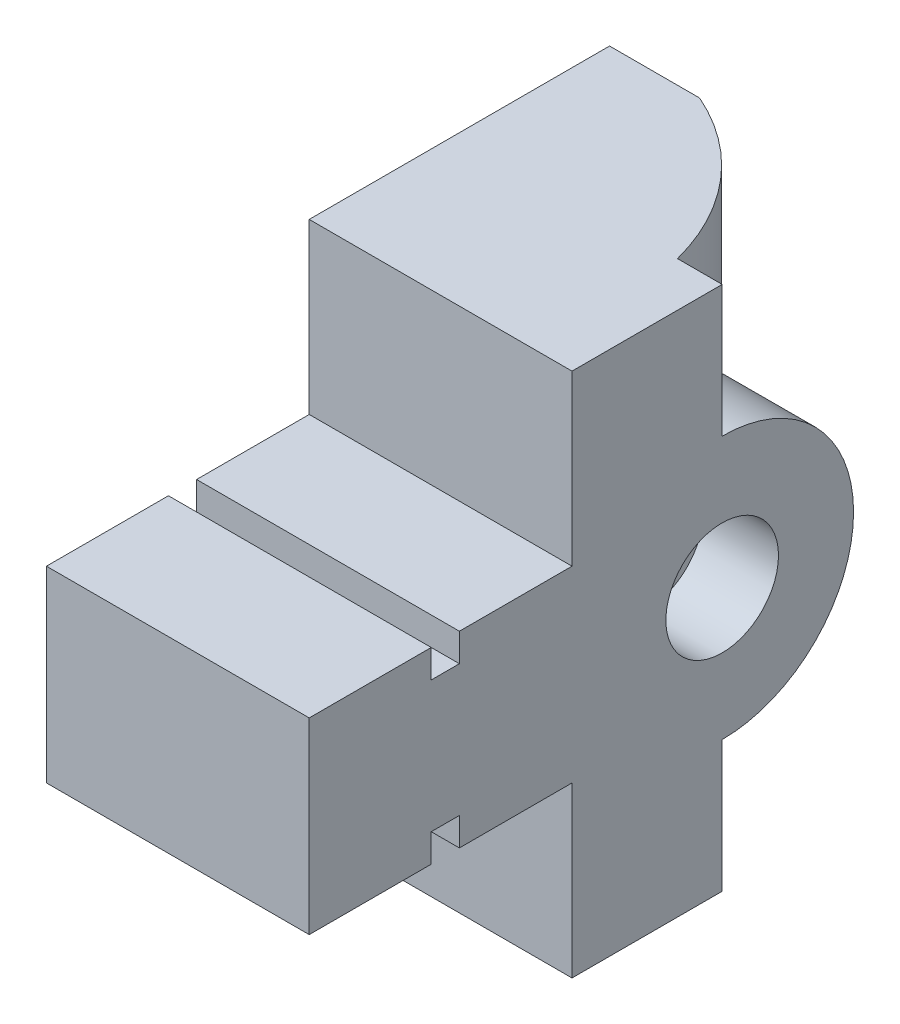
ISO-10303-21;
HEADER;
FILE_DESCRIPTION(('STEP AP214'),'2;1');
FILE_NAME('part.step','',(''),(''),'','','');
FILE_SCHEMA(('AUTOMOTIVE_DESIGN { 1 0 10303 214 1 1 1 1 }'));
ENDSEC;
DATA;
#1=APPLICATION_CONTEXT('core data for automotive mechanical design processes');
#2=APPLICATION_PROTOCOL_DEFINITION('international standard','automotive_design',2000,#1);
#3=PRODUCT_CONTEXT('',#1,'mechanical');
#4=PRODUCT('Part','Part','',(#3));
#5=PRODUCT_RELATED_PRODUCT_CATEGORY('part','',(#4));
#6=PRODUCT_DEFINITION_FORMATION('','',#4);
#7=PRODUCT_DEFINITION_CONTEXT('part definition',#1,'design');
#8=PRODUCT_DEFINITION('design','',#6,#7);
#9=PRODUCT_DEFINITION_SHAPE('','',#8);
#10=(LENGTH_UNIT() NAMED_UNIT(*) SI_UNIT(.MILLI.,.METRE.));
#11=(NAMED_UNIT(*) PLANE_ANGLE_UNIT() SI_UNIT($,.RADIAN.));
#12=(NAMED_UNIT(*) SI_UNIT($,.STERADIAN.) SOLID_ANGLE_UNIT());
#13=UNCERTAINTY_MEASURE_WITH_UNIT(LENGTH_MEASURE(1.E-05),#10,'distance_accuracy_value','');
#14=(GEOMETRIC_REPRESENTATION_CONTEXT(3) GLOBAL_UNCERTAINTY_ASSIGNED_CONTEXT((#13)) GLOBAL_UNIT_ASSIGNED_CONTEXT((#10,
#11,#12)) REPRESENTATION_CONTEXT('',''));
#15=CARTESIAN_POINT('',(0.,0.,0.));
#16=DIRECTION('',(0.,0.,1.));
#17=DIRECTION('',(1.,0.,0.));
#18=AXIS2_PLACEMENT_3D('',#15,#16,#17);
#19=CARTESIAN_POINT('',(0.,88.9,44.45));
#20=DIRECTION('',(0.,0.,-1.));
#21=DIRECTION('',(-1.,0.,0.));
#22=AXIS2_PLACEMENT_3D('',#19,#20,#21);
#23=PLANE('',#22);
#24=DIRECTION('',(1.,0.,0.));
#25=VECTOR('',#24,1.);
#26=CARTESIAN_POINT('',(0.,60.325,44.45));
#27=LINE('',#26,#25);
#28=CARTESIAN_POINT('',(0.,60.325,44.45));
#29=VERTEX_POINT('',#28);
#30=CARTESIAN_POINT('',(44.45,60.325,44.45));
#31=VERTEX_POINT('',#30);
#32=EDGE_CURVE('E218',#29,#31,#27,.T.);
#33=ORIENTED_EDGE('',*,*,#32,.F.);
#34=DIRECTION('',(0.,-1.,0.));
#35=VECTOR('',#34,1.);
#36=CARTESIAN_POINT('',(0.,88.9,44.45));
#37=LINE('',#36,#35);
#38=CARTESIAN_POINT('',(0.,28.575,44.45));
#39=VERTEX_POINT('',#38);
#40=EDGE_CURVE('E11',#29,#39,#37,.T.);
#41=ORIENTED_EDGE('',*,*,#40,.T.);
#42=DIRECTION('',(1.,0.,0.));
#43=VECTOR('',#42,1.);
#44=CARTESIAN_POINT('',(0.,28.575,44.45));
#45=LINE('',#44,#43);
#46=CARTESIAN_POINT('',(44.45,28.575,44.45));
#47=VERTEX_POINT('',#46);
#48=EDGE_CURVE('E272',#39,#47,#45,.T.);
#49=ORIENTED_EDGE('',*,*,#48,.T.);
#50=DIRECTION('',(0.,-1.,0.));
#51=VECTOR('',#50,1.);
#52=CARTESIAN_POINT('',(44.45,88.9,44.45));
#53=LINE('',#52,#51);
#54=EDGE_CURVE('E43',#31,#47,#53,.T.);
#55=ORIENTED_EDGE('',*,*,#54,.F.);
#56=EDGE_LOOP('',(#33,#41,#49,#55));
#57=FACE_BOUND('',#56,.T.);
#58=ADVANCED_FACE('F36',(#57),#23,.F.);
#59=CARTESIAN_POINT('',(44.45,88.9,44.45));
#60=DIRECTION('',(-1.,0.,0.));
#61=DIRECTION('',(0.,0.,1.));
#62=AXIS2_PLACEMENT_3D('',#59,#60,#61);
#63=PLANE('',#62);
#64=CARTESIAN_POINT('',(44.45,44.45,-25.4));
#65=DIRECTION('',(1.,0.,0.));
#66=DIRECTION('',(0.,0.,-1.));
#67=AXIS2_PLACEMENT_3D('',#64,#65,#66);
#68=CIRCLE('',#67,9.525);
#69=CARTESIAN_POINT('',(44.45,44.45,-34.925));
#70=VERTEX_POINT('',#69);
#71=EDGE_CURVE('E220',#70,#70,#68,.T.);
#72=ORIENTED_EDGE('',*,*,#71,.F.);
#73=EDGE_LOOP('',(#72));
#74=FACE_BOUND('',#73,.T.);
#75=DIRECTION('',(0.,0.,1.));
#76=VECTOR('',#75,1.);
#77=CARTESIAN_POINT('',(44.45,60.325,0.));
#78=LINE('',#77,#76);
#79=CARTESIAN_POINT('',(44.45,60.325,23.8125));
#80=VERTEX_POINT('',#79);
#81=EDGE_CURVE('E189',#80,#31,#78,.T.);
#82=ORIENTED_EDGE('',*,*,#81,.T.);
#83=ORIENTED_EDGE('',*,*,#54,.T.);
#84=DIRECTION('',(0.,0.,1.));
#85=VECTOR('',#84,1.);
#86=CARTESIAN_POINT('',(44.45,28.575,0.));
#87=LINE('',#86,#85);
#88=CARTESIAN_POINT('',(44.45,28.575,23.8125));
#89=VERTEX_POINT('',#88);
#90=EDGE_CURVE('E250',#89,#47,#87,.T.);
#91=ORIENTED_EDGE('',*,*,#90,.F.);
#92=DIRECTION('',(0.,-1.,0.));
#93=VECTOR('',#92,1.);
#94=CARTESIAN_POINT('',(44.45,0.,23.8125));
#95=LINE('',#94,#93);
#96=CARTESIAN_POINT('',(44.45,33.3375,23.8125));
#97=VERTEX_POINT('',#96);
#98=EDGE_CURVE('E247',#97,#89,#95,.T.);
#99=ORIENTED_EDGE('',*,*,#98,.F.);
#100=DIRECTION('',(0.,0.,1.));
#101=VECTOR('',#100,1.);
#102=CARTESIAN_POINT('',(44.45,33.3375,0.));
#103=LINE('',#102,#101);
#104=CARTESIAN_POINT('',(44.45,33.3375,19.05));
#105=VERTEX_POINT('',#104);
#106=EDGE_CURVE('E234',#105,#97,#103,.T.);
#107=ORIENTED_EDGE('',*,*,#106,.F.);
#108=DIRECTION('',(0.,1.,0.));
#109=VECTOR('',#108,1.);
#110=CARTESIAN_POINT('',(44.45,0.,19.05));
#111=LINE('',#110,#109);
#112=CARTESIAN_POINT('',(44.45,28.575,19.05));
#113=VERTEX_POINT('',#112);
#114=EDGE_CURVE('E258',#113,#105,#111,.T.);
#115=ORIENTED_EDGE('',*,*,#114,.F.);
#116=DIRECTION('',(0.,0.,1.));
#117=VECTOR('',#116,1.);
#118=CARTESIAN_POINT('',(44.45,28.575,0.));
#119=LINE('',#118,#117);
#120=CARTESIAN_POINT('',(44.45,28.575,0.));
#121=VERTEX_POINT('',#120);
#122=EDGE_CURVE('E255',#121,#113,#119,.T.);
#123=ORIENTED_EDGE('',*,*,#122,.F.);
#124=DIRECTION('',(0.,1.,0.));
#125=VECTOR('',#124,1.);
#126=CARTESIAN_POINT('',(44.45,0.,0.));
#127=LINE('',#126,#125);
#128=CARTESIAN_POINT('',(44.45,0.,0.));
#129=VERTEX_POINT('',#128);
#130=EDGE_CURVE('E252',#129,#121,#127,.T.);
#131=ORIENTED_EDGE('',*,*,#130,.F.);
#132=DIRECTION('',(0.,0.,-1.));
#133=VECTOR('',#132,1.);
#134=CARTESIAN_POINT('',(44.45,0.,44.45));
#135=LINE('',#134,#133);
#136=CARTESIAN_POINT('',(44.45,0.,-25.4));
#137=VERTEX_POINT('',#136);
#138=EDGE_CURVE('E298',#129,#137,#135,.T.);
#139=ORIENTED_EDGE('',*,*,#138,.T.);
#140=DIRECTION('',(0.,-1.,0.));
#141=VECTOR('',#140,1.);
#142=CARTESIAN_POINT('',(44.45,88.9,-25.4));
#143=LINE('',#142,#141);
#144=CARTESIAN_POINT('',(44.45,22.225,-25.4));
#145=VERTEX_POINT('',#144);
#146=EDGE_CURVE('E385',#145,#137,#143,.T.);
#147=ORIENTED_EDGE('',*,*,#146,.F.);
#148=CARTESIAN_POINT('',(44.45,44.45,-25.4));
#149=DIRECTION('',(1.,0.,0.));
#150=DIRECTION('',(0.,0.,-1.));
#151=AXIS2_PLACEMENT_3D('',#148,#149,#150);
#152=CIRCLE('',#151,22.225);
#153=CARTESIAN_POINT('',(44.45,66.675,-25.4));
#154=VERTEX_POINT('',#153);
#155=EDGE_CURVE('E279',#145,#154,#152,.T.);
#156=ORIENTED_EDGE('',*,*,#155,.T.);
#157=CARTESIAN_POINT('',(44.45,88.9,-25.4));
#158=VERTEX_POINT('',#157);
#159=EDGE_CURVE('E386',#158,#154,#143,.T.);
#160=ORIENTED_EDGE('',*,*,#159,.F.);
#161=DIRECTION('',(0.,0.,-1.));
#162=VECTOR('',#161,1.);
#163=CARTESIAN_POINT('',(44.45,88.9,44.45));
#164=LINE('',#163,#162);
#165=CARTESIAN_POINT('',(44.45,88.9,0.));
#166=VERTEX_POINT('',#165);
#167=EDGE_CURVE('E365',#166,#158,#164,.T.);
#168=ORIENTED_EDGE('',*,*,#167,.F.);
#169=DIRECTION('',(0.,-1.,0.));
#170=VECTOR('',#169,1.);
#171=CARTESIAN_POINT('',(44.45,0.,0.));
#172=LINE('',#171,#170);
#173=CARTESIAN_POINT('',(44.45,60.325,0.));
#174=VERTEX_POINT('',#173);
#175=EDGE_CURVE('E50',#166,#174,#172,.T.);
#176=ORIENTED_EDGE('',*,*,#175,.T.);
#177=DIRECTION('',(0.,0.,1.));
#178=VECTOR('',#177,1.);
#179=CARTESIAN_POINT('',(44.45,60.325,0.));
#180=LINE('',#179,#178);
#181=CARTESIAN_POINT('',(44.45,60.325,19.05));
#182=VERTEX_POINT('',#181);
#183=EDGE_CURVE('E197',#174,#182,#180,.T.);
#184=ORIENTED_EDGE('',*,*,#183,.T.);
#185=DIRECTION('',(0.,-1.,0.));
#186=VECTOR('',#185,1.);
#187=CARTESIAN_POINT('',(44.45,0.,19.05));
#188=LINE('',#187,#186);
#189=CARTESIAN_POINT('',(44.45,55.5625,19.05));
#190=VERTEX_POINT('',#189);
#191=EDGE_CURVE('E213',#182,#190,#188,.T.);
#192=ORIENTED_EDGE('',*,*,#191,.T.);
#193=DIRECTION('',(0.,0.,1.));
#194=VECTOR('',#193,1.);
#195=CARTESIAN_POINT('',(44.45,55.5625,0.));
#196=LINE('',#195,#194);
#197=CARTESIAN_POINT('',(44.45,55.5625,23.8125));
#198=VERTEX_POINT('',#197);
#199=EDGE_CURVE('E210',#190,#198,#196,.T.);
#200=ORIENTED_EDGE('',*,*,#199,.T.);
#201=DIRECTION('',(0.,1.,0.));
#202=VECTOR('',#201,1.);
#203=CARTESIAN_POINT('',(44.45,0.,23.8125));
#204=LINE('',#203,#202);
#205=EDGE_CURVE('E207',#198,#80,#204,.T.);
#206=ORIENTED_EDGE('',*,*,#205,.T.);
#207=EDGE_LOOP('',(#82,#83,#91,#99,#107,#115,#123,#131,#139,#147,#156,#160,#168,#176,#184,#192,
#200,#206));
#208=FACE_BOUND('',#207,.T.);
#209=ADVANCED_FACE('F324',(#74,#208),#63,.F.);
#210=CARTESIAN_POINT('',(0.,88.9,0.));
#211=DIRECTION('',(1.,0.,0.));
#212=DIRECTION('',(0.,0.,-1.));
#213=AXIS2_PLACEMENT_3D('',#210,#211,#212);
#214=PLANE('',#213);
#215=DIRECTION('',(0.,0.,1.));
#216=VECTOR('',#215,1.);
#217=CARTESIAN_POINT('',(0.,60.325,0.));
#218=LINE('',#217,#216);
#219=CARTESIAN_POINT('',(0.,60.325,23.8125));
#220=VERTEX_POINT('',#219);
#221=EDGE_CURVE('E183',#220,#29,#218,.T.);
#222=ORIENTED_EDGE('',*,*,#221,.F.);
#223=DIRECTION('',(0.,1.,0.));
#224=VECTOR('',#223,1.);
#225=CARTESIAN_POINT('',(0.,0.,23.8125));
#226=LINE('',#225,#224);
#227=CARTESIAN_POINT('',(0.,55.5625,23.8125));
#228=VERTEX_POINT('',#227);
#229=EDGE_CURVE('E172',#228,#220,#226,.T.);
#230=ORIENTED_EDGE('',*,*,#229,.F.);
#231=DIRECTION('',(0.,0.,1.));
#232=VECTOR('',#231,1.);
#233=CARTESIAN_POINT('',(0.,55.5625,0.));
#234=LINE('',#233,#232);
#235=CARTESIAN_POINT('',(0.,55.5625,19.05));
#236=VERTEX_POINT('',#235);
#237=EDGE_CURVE('E182',#236,#228,#234,.T.);
#238=ORIENTED_EDGE('',*,*,#237,.F.);
#239=DIRECTION('',(0.,-1.,0.));
#240=VECTOR('',#239,1.);
#241=CARTESIAN_POINT('',(0.,0.,19.05));
#242=LINE('',#241,#240);
#243=CARTESIAN_POINT('',(0.,60.325,19.05));
#244=VERTEX_POINT('',#243);
#245=EDGE_CURVE('E201',#244,#236,#242,.T.);
#246=ORIENTED_EDGE('',*,*,#245,.F.);
#247=DIRECTION('',(0.,0.,1.));
#248=VECTOR('',#247,1.);
#249=CARTESIAN_POINT('',(0.,60.325,0.));
#250=LINE('',#249,#248);
#251=CARTESIAN_POINT('',(0.,60.325,0.));
#252=VERTEX_POINT('',#251);
#253=EDGE_CURVE('E203',#252,#244,#250,.T.);
#254=ORIENTED_EDGE('',*,*,#253,.F.);
#255=DIRECTION('',(0.,-1.,0.));
#256=VECTOR('',#255,1.);
#257=CARTESIAN_POINT('',(0.,0.,0.));
#258=LINE('',#257,#256);
#259=CARTESIAN_POINT('',(0.,88.9,0.));
#260=VERTEX_POINT('',#259);
#261=EDGE_CURVE('E191',#260,#252,#258,.T.);
#262=ORIENTED_EDGE('',*,*,#261,.F.);
#263=DIRECTION('',(0.,0.,1.));
#264=VECTOR('',#263,1.);
#265=CARTESIAN_POINT('',(0.,88.9,0.));
#266=LINE('',#265,#264);
#267=CARTESIAN_POINT('',(0.,88.9,-50.8));
#268=VERTEX_POINT('',#267);
#269=EDGE_CURVE('E299',#268,#260,#266,.T.);
#270=ORIENTED_EDGE('',*,*,#269,.F.);
#271=DIRECTION('',(0.,-1.,0.));
#272=VECTOR('',#271,1.);
#273=CARTESIAN_POINT('',(0.,88.9,-50.8));
#274=LINE('',#273,#272);
#275=CARTESIAN_POINT('',(0.,0.,-50.8));
#276=VERTEX_POINT('',#275);
#277=EDGE_CURVE('E376',#268,#276,#274,.T.);
#278=ORIENTED_EDGE('',*,*,#277,.T.);
#279=DIRECTION('',(0.,0.,1.));
#280=VECTOR('',#279,1.);
#281=CARTESIAN_POINT('',(0.,0.,0.));
#282=LINE('',#281,#280);
#283=CARTESIAN_POINT('',(0.,0.,0.));
#284=VERTEX_POINT('',#283);
#285=EDGE_CURVE('E366',#276,#284,#282,.T.);
#286=ORIENTED_EDGE('',*,*,#285,.T.);
#287=DIRECTION('',(0.,1.,0.));
#288=VECTOR('',#287,1.);
#289=CARTESIAN_POINT('',(0.,0.,0.));
#290=LINE('',#289,#288);
#291=CARTESIAN_POINT('',(0.,28.575,0.));
#292=VERTEX_POINT('',#291);
#293=EDGE_CURVE('E58',#284,#292,#290,.T.);
#294=ORIENTED_EDGE('',*,*,#293,.T.);
#295=DIRECTION('',(0.,0.,1.));
#296=VECTOR('',#295,1.);
#297=CARTESIAN_POINT('',(0.,28.575,0.));
#298=LINE('',#297,#296);
#299=CARTESIAN_POINT('',(0.,28.575,19.05));
#300=VERTEX_POINT('',#299);
#301=EDGE_CURVE('E237',#292,#300,#298,.T.);
#302=ORIENTED_EDGE('',*,*,#301,.T.);
#303=DIRECTION('',(0.,1.,0.));
#304=VECTOR('',#303,1.);
#305=CARTESIAN_POINT('',(0.,0.,19.05));
#306=LINE('',#305,#304);
#307=CARTESIAN_POINT('',(0.,33.3375,19.05));
#308=VERTEX_POINT('',#307);
#309=EDGE_CURVE('E240',#300,#308,#306,.T.);
#310=ORIENTED_EDGE('',*,*,#309,.T.);
#311=DIRECTION('',(0.,0.,1.));
#312=VECTOR('',#311,1.);
#313=CARTESIAN_POINT('',(0.,33.3375,0.));
#314=LINE('',#313,#312);
#315=CARTESIAN_POINT('',(0.,33.3375,23.8125));
#316=VERTEX_POINT('',#315);
#317=EDGE_CURVE('E243',#308,#316,#314,.T.);
#318=ORIENTED_EDGE('',*,*,#317,.T.);
#319=DIRECTION('',(0.,-1.,0.));
#320=VECTOR('',#319,1.);
#321=CARTESIAN_POINT('',(0.,0.,23.8125));
#322=LINE('',#321,#320);
#323=CARTESIAN_POINT('',(0.,28.575,23.8125));
#324=VERTEX_POINT('',#323);
#325=EDGE_CURVE('E230',#316,#324,#322,.T.);
#326=ORIENTED_EDGE('',*,*,#325,.T.);
#327=DIRECTION('',(0.,0.,1.));
#328=VECTOR('',#327,1.);
#329=CARTESIAN_POINT('',(0.,28.575,0.));
#330=LINE('',#329,#328);
#331=EDGE_CURVE('E233',#324,#39,#330,.T.);
#332=ORIENTED_EDGE('',*,*,#331,.T.);
#333=ORIENTED_EDGE('',*,*,#40,.F.);
#334=EDGE_LOOP('',(#222,#230,#238,#246,#254,#262,#270,#278,#286,#294,#302,#310,#318,#326,#332,#333));
#335=FACE_BOUND('',#334,.T.);
#336=ADVANCED_FACE('F194',(#335),#214,.F.);
#337=CARTESIAN_POINT('',(0.,88.9,-15.875));
#338=DIRECTION('',(0.,1.,0.));
#339=DIRECTION('',(0.,0.,1.));
#340=AXIS2_PLACEMENT_3D('',#337,#338,#339);
#341=PLANE('',#340);
#342=ORIENTED_EDGE('',*,*,#269,.T.);
#343=DIRECTION('',(1.,0.,0.));
#344=VECTOR('',#343,1.);
#345=CARTESIAN_POINT('',(0.,88.9,0.));
#346=LINE('',#345,#344);
#347=EDGE_CURVE('E221',#260,#166,#346,.T.);
#348=ORIENTED_EDGE('',*,*,#347,.T.);
#349=ORIENTED_EDGE('',*,*,#167,.T.);
#350=DIRECTION('',(-1.,0.,0.));
#351=VECTOR('',#350,1.);
#352=CARTESIAN_POINT('',(44.45,88.9,-25.4));
#353=LINE('',#352,#351);
#354=CARTESIAN_POINT('',(36.8901663726257,88.9,-25.4));
#355=VERTEX_POINT('',#354);
#356=EDGE_CURVE('E367',#158,#355,#353,.T.);
#357=ORIENTED_EDGE('',*,*,#356,.T.);
#358=CARTESIAN_POINT('',(0.,88.9,-15.875));
#359=DIRECTION('',(0.,1.,0.));
#360=DIRECTION('',(0.,0.,1.));
#361=AXIS2_PLACEMENT_3D('',#358,#359,#360);
#362=CIRCLE('',#361,38.1);
#363=CARTESIAN_POINT('',(15.2267650865179,88.9,-50.8));
#364=VERTEX_POINT('',#363);
#365=EDGE_CURVE('E406',#355,#364,#362,.T.);
#366=ORIENTED_EDGE('',*,*,#365,.T.);
#367=DIRECTION('',(-1.,0.,0.));
#368=VECTOR('',#367,1.);
#369=CARTESIAN_POINT('',(0.,88.9,-50.8));
#370=LINE('',#369,#368);
#371=EDGE_CURVE('E363',#364,#268,#370,.T.);
#372=ORIENTED_EDGE('',*,*,#371,.T.);
#373=EDGE_LOOP('',(#342,#348,#349,#357,#366,#372));
#374=FACE_BOUND('',#373,.T.);
#375=ADVANCED_FACE('F314',(#374),#341,.T.);
#376=CARTESIAN_POINT('',(44.45,88.9,-25.4));
#377=DIRECTION('',(0.,0.,1.));
#378=DIRECTION('',(1.,0.,0.));
#379=AXIS2_PLACEMENT_3D('',#376,#377,#378);
#380=PLANE('',#379);
#381=DIRECTION('',(0.,-1.,0.));
#382=VECTOR('',#381,1.);
#383=CARTESIAN_POINT('',(36.8901663726257,88.9,-25.4));
#384=LINE('',#383,#382);
#385=CARTESIAN_POINT('',(36.8901663726257,22.225,-25.4));
#386=VERTEX_POINT('',#385);
#387=CARTESIAN_POINT('',(36.8901663726257,0.,-25.4));
#388=VERTEX_POINT('',#387);
#389=EDGE_CURVE('E381',#386,#388,#384,.T.);
#390=ORIENTED_EDGE('',*,*,#389,.F.);
#391=DIRECTION('',(1.,0.,0.));
#392=VECTOR('',#391,1.);
#393=CARTESIAN_POINT('',(0.,22.225,-25.4));
#394=LINE('',#393,#392);
#395=EDGE_CURVE('E285',#386,#145,#394,.T.);
#396=ORIENTED_EDGE('',*,*,#395,.T.);
#397=ORIENTED_EDGE('',*,*,#146,.T.);
#398=DIRECTION('',(-1.,0.,0.));
#399=VECTOR('',#398,1.);
#400=CARTESIAN_POINT('',(44.45,0.,-25.4));
#401=LINE('',#400,#399);
#402=EDGE_CURVE('E398',#137,#388,#401,.T.);
#403=ORIENTED_EDGE('',*,*,#402,.T.);
#404=EDGE_LOOP('',(#390,#396,#397,#403));
#405=FACE_BOUND('',#404,.T.);
#406=ADVANCED_FACE('F317',(#405),#380,.F.);
#407=ORIENTED_EDGE('',*,*,#159,.T.);
#408=DIRECTION('',(1.,0.,0.));
#409=VECTOR('',#408,1.);
#410=CARTESIAN_POINT('',(0.,66.675,-25.4));
#411=LINE('',#410,#409);
#412=CARTESIAN_POINT('',(36.8901663726257,66.675,-25.4));
#413=VERTEX_POINT('',#412);
#414=EDGE_CURVE('E284',#413,#154,#411,.T.);
#415=ORIENTED_EDGE('',*,*,#414,.F.);
#416=EDGE_CURVE('E382',#355,#413,#384,.T.);
#417=ORIENTED_EDGE('',*,*,#416,.F.);
#418=ORIENTED_EDGE('',*,*,#356,.F.);
#419=EDGE_LOOP('',(#407,#415,#417,#418));
#420=FACE_BOUND('',#419,.T.);
#421=ADVANCED_FACE('F330',(#420),#380,.F.);
#422=CARTESIAN_POINT('',(0.,88.9,-15.875));
#423=DIRECTION('',(0.,-1.,0.));
#424=DIRECTION('',(0.,0.,-1.));
#425=AXIS2_PLACEMENT_3D('',#422,#423,#424);
#426=CYLINDRICAL_SURFACE('',#425,38.1);
#427=ORIENTED_EDGE('',*,*,#416,.T.);
#428=CARTESIAN_POINT('',(36.8901663726257,66.675,-25.4));
#429=CARTESIAN_POINT('',(36.8095868270974,66.6750071913824,-25.7121214866556));
#430=CARTESIAN_POINT('',(36.7250319789874,66.6684252611217,-26.0231995010628));
#431=CARTESIAN_POINT('',(36.5482247349935,66.6423996043465,-26.6425804407329));
#432=CARTESIAN_POINT('',(36.4559732475843,66.6229573939267,-26.95088368877));
#433=CARTESIAN_POINT('',(36.2641069764411,66.5715543494902,-27.5637804257595));
#434=CARTESIAN_POINT('',(36.1644999882211,66.5396066188802,-27.8683774547873));
#435=CARTESIAN_POINT('',(35.9581398001562,66.4635577148169,-28.4735893221662));
#436=CARTESIAN_POINT('',(35.8513864124221,66.4194562217287,-28.7742040555678));
#437=CARTESIAN_POINT('',(35.5225788389677,66.2702565066264,-29.6646455836141));
#438=CARTESIAN_POINT('',(35.2904389259198,66.1478405761367,-30.2479670037491));
#439=CARTESIAN_POINT('',(34.8019705305777,65.8597822680545,-31.3934052759273));
#440=CARTESIAN_POINT('',(34.5456360618123,65.6941291742756,-31.95551683159));
#441=CARTESIAN_POINT('',(34.0129257857331,65.32363129979,-33.05352110756));
#442=CARTESIAN_POINT('',(33.7366415958502,65.118959384113,-33.5895168475684));
#443=CARTESIAN_POINT('',(33.1661063734081,64.6730245192709,-34.6359860846106));
#444=CARTESIAN_POINT('',(32.8718564269342,64.431763780707,-35.1464611210631));
#445=CARTESIAN_POINT('',(32.2677429830714,63.9148385597341,-36.1417810040405));
#446=CARTESIAN_POINT('',(31.9578468140246,63.6391001480667,-36.6265674875704));
#447=CARTESIAN_POINT('',(31.3260719269909,63.0560355696035,-37.568522084599));
#448=CARTESIAN_POINT('',(31.0041924374625,62.7487073666597,-38.025688414797));
#449=CARTESIAN_POINT('',(30.2984896026693,62.052108901506,-38.9838866378474));
#450=CARTESIAN_POINT('',(29.913095582304,61.6576365797569,-39.4799855090305));
#451=CARTESIAN_POINT('',(29.1351581577832,60.8309615607438,-40.4337324773807));
#452=CARTESIAN_POINT('',(28.7426136273818,60.3987528784058,-40.8913744525248));
#453=CARTESIAN_POINT('',(27.9556010606081,59.4978637380717,-41.7678825761355));
#454=CARTESIAN_POINT('',(27.5611323706471,59.0291699413521,-42.1867344194739));
#455=CARTESIAN_POINT('',(26.7765077943844,58.0559287101244,-42.9848048831905));
#456=CARTESIAN_POINT('',(26.3863510945264,57.5513881771363,-43.3640310980834));
#457=CARTESIAN_POINT('',(25.6891082366993,56.6030441903805,-44.0150623060142));
#458=CARTESIAN_POINT('',(25.3800614907823,56.165383730826,-44.2937319070137));
#459=CARTESIAN_POINT('',(24.7745051392307,55.2650147622171,-44.8231526709689));
#460=CARTESIAN_POINT('',(24.4779966730758,54.8023039852643,-45.0739012998324));
#461=CARTESIAN_POINT('',(23.9041106150915,53.8515362897324,-45.5455448898113));
#462=CARTESIAN_POINT('',(23.6267056262927,53.3635175060006,-45.7664830589305));
#463=CARTESIAN_POINT('',(23.0983687701951,52.3605455341929,-46.1766014516222));
#464=CARTESIAN_POINT('',(22.8474248588997,51.8456047609422,-46.3657961469053));
#465=CARTESIAN_POINT('',(22.4590745967514,50.9639402974431,-46.6522231194309));
#466=CARTESIAN_POINT('',(22.3116332009659,50.604765117824,-46.7591335143051));
#467=CARTESIAN_POINT('',(22.0363405320714,49.8745415109289,-46.9561569779629));
#468=CARTESIAN_POINT('',(21.9084828613514,49.5034970092116,-47.046275534396));
#469=CARTESIAN_POINT('',(21.6761462005743,48.7508417729058,-47.2082851746884));
#470=CARTESIAN_POINT('',(21.5716319065502,48.3692479886956,-47.2802038058996));
#471=CARTESIAN_POINT('',(21.3893830207117,47.5965380942272,-47.404613238648));
#472=CARTESIAN_POINT('',(21.3116478515215,47.2054221894668,-47.4571044590549));
#473=CARTESIAN_POINT('',(21.1854528500271,46.4116336155859,-47.5418989640199));
#474=CARTESIAN_POINT('',(21.137337104967,46.0088800078926,-47.5739651149534));
#475=CARTESIAN_POINT('',(21.0740910121307,45.1996227310354,-47.6160485717893));
#476=CARTESIAN_POINT('',(21.0589592675944,44.7931192213991,-47.6260668113457));
#477=CARTESIAN_POINT('',(21.062447251749,43.9803066535786,-47.6237529744756));
#478=CARTESIAN_POINT('',(21.0810685739605,43.573997605481,-47.6114198428154));
#479=CARTESIAN_POINT('',(21.1511239438085,42.7655288185118,-47.5647728179837));
#480=CARTESIAN_POINT('',(21.2025578369492,42.3633690601127,-47.5304590283065));
#481=CARTESIAN_POINT('',(21.3267459653363,41.6206663028787,-47.4468963139309));
#482=CARTESIAN_POINT('',(21.3956605892405,41.2791665498672,-47.4003054851285));
#483=CARTESIAN_POINT('',(21.5540097509567,40.6033049858027,-47.2922541841316));
#484=CARTESIAN_POINT('',(21.6434513539753,40.2689456758399,-47.2307885917761));
#485=CARTESIAN_POINT('',(21.9390022085946,39.278231121762,-47.0254030206541));
#486=CARTESIAN_POINT('',(22.1723482805876,38.6341792012097,-46.860487237938));
#487=CARTESIAN_POINT('',(22.6623526130823,37.4552929969316,-46.5035612263354));
#488=CARTESIAN_POINT('',(22.9133132716788,36.9163816683637,-46.31678930601));
#489=CARTESIAN_POINT('',(23.4457913735968,35.8671938574336,-45.9086058287393));
#490=CARTESIAN_POINT('',(23.727329208911,35.3569368330364,-45.6871711111167));
#491=CARTESIAN_POINT('',(24.3127227697084,34.3628645241863,-45.2117376491236));
#492=CARTESIAN_POINT('',(24.6166465960408,33.879138451101,-44.9576376253208));
#493=CARTESIAN_POINT('',(25.2388965942426,32.9387013516818,-44.4193075759514));
#494=CARTESIAN_POINT('',(25.5572212283589,32.4819874528831,-44.1350807630638));
#495=CARTESIAN_POINT('',(26.3238235332273,31.4280048308331,-43.4255292389369));
#496=CARTESIAN_POINT('',(26.7760569350679,30.8422761932056,-42.9872703317294));
#497=CARTESIAN_POINT('',(27.685850219335,29.7188285521483,-42.0575762248366));
#498=CARTESIAN_POINT('',(28.1434120503918,29.1811277784747,-41.5661209888526));
#499=CARTESIAN_POINT('',(29.0542420060894,28.155119638483,-40.5313553188858));
#500=CARTESIAN_POINT('',(29.5075128225426,27.6667791496311,-39.9880801401893));
#501=CARTESIAN_POINT('',(30.4018916975265,26.7417862662272,-38.8501694576334));
#502=CARTESIAN_POINT('',(30.8430037497633,26.3051167406669,-38.2555510898415));
#503=CARTESIAN_POINT('',(31.6246045832454,25.5643300841148,-37.1322526111136));
#504=CARTESIAN_POINT('',(31.9684394158994,25.250717294485,-36.6121450371228));
#505=CARTESIAN_POINT('',(32.6392213448588,24.6632440775529,-35.5394659583387));
#506=CARTESIAN_POINT('',(32.9661686728506,24.3893831047865,-34.9868948991471));
#507=CARTESIAN_POINT('',(33.598219420989,23.8857081792741,-33.8524868854474));
#508=CARTESIAN_POINT('',(33.9033846830537,23.6557661433809,-33.2707414787216));
#509=CARTESIAN_POINT('',(34.4889399448352,23.2428883963895,-32.0788110806434));
#510=CARTESIAN_POINT('',(34.7693366291212,23.059939977019,-31.4686338308288));
#511=CARTESIAN_POINT('',(35.220378265205,22.793159736462,-30.4131138641579));
#512=CARTESIAN_POINT('',(35.398423533049,22.6961141087099,-29.9742247155552));
#513=CARTESIAN_POINT('',(35.7394713326725,22.5281060305895,-29.0858451147772));
#514=CARTESIAN_POINT('',(35.9024781835346,22.4571360736283,-28.6363577533011));
#515=CARTESIAN_POINT('',(36.2130604230627,22.3423203151461,-27.7264254114428));
#516=CARTESIAN_POINT('',(36.3605667450489,22.2985919610946,-27.265941751978));
#517=CARTESIAN_POINT('',(36.5689419932966,22.254593908931,-26.569917220262));
#518=CARTESIAN_POINT('',(36.6362759847333,22.2435268758184,-26.336937053786));
#519=CARTESIAN_POINT('',(36.7665437429338,22.2287293329917,-25.86950584398));
#520=CARTESIAN_POINT('',(36.8294772828786,22.2249992011859,-25.6350547255084));
#521=CARTESIAN_POINT('',(36.8901663726257,22.225,-25.4));
#522=B_SPLINE_CURVE_WITH_KNOTS('',3,(#428,#429,#430,#431,#432,#433,#434,#435,#436,#437,#438,
#439,#440,#441,#442,#443,#444,#445,#446,#447,#448,#449,#450,#451,#452,#453,#454,#455,#456,#457,
#458,#459,#460,#461,#462,#463,#464,#465,#466,#467,#468,#469,#470,#471,#472,#473,#474,#475,#476,
#477,#478,#479,#480,#481,#482,#483,#484,#485,#486,#487,#488,#489,#490,#491,#492,#493,#494,#495,
#496,#497,#498,#499,#500,#501,#502,#503,#504,#505,#506,#507,#508,#509,#510,#511,#512,#513,#514,
#515,#516,#517,#518,#519,#520,#521),.UNSPECIFIED.,.F.,.F.,(4,2,2,2,2,2,2,2,2,2,2,2,2,2,2,2,2,2,
2,2,2,2,2,2,2,2,2,2,2,2,2,2,2,2,2,2,2,2,2,2,2,2,2,2,2,2,4),(0.,0.966946546359402,
1.93377911997826,2.89960133712228,3.86544895709586,5.78174819802966,7.69852283906589,
9.6069950522527,11.515352006418,13.4278735082359,15.340518360713,17.5637693143102,
19.7873735234168,22.0117945207286,24.2357884079995,26.0463822145732,27.8571402159515,
29.6652448012146,31.4725228264416,32.6798055370269,33.8866930074571,35.0917426609465,
36.2967663311375,37.5155368164446,38.7342556899694,39.9530321020967,41.1718027757406,
42.2252100371294,43.2789804172942,45.3863386344684,47.253252976196,49.121420102874,
50.9955259061714,52.8694320580996,55.4462640556368,58.0240700118105,60.6001345202206,
63.175342552083,65.2671844358385,67.358997613171,69.4446139238643,71.5296656355349,
72.9791149508341,74.4281466750874,75.8833831826859,76.6115505681609,77.3397554590233),.UNSPECIFIED.);
#523=EDGE_CURVE('E288',#413,#386,#522,.T.);
#524=ORIENTED_EDGE('',*,*,#523,.T.);
#525=ORIENTED_EDGE('',*,*,#389,.T.);
#526=CARTESIAN_POINT('',(0.,0.,-15.875));
#527=DIRECTION('',(0.,1.,0.));
#528=DIRECTION('',(0.,0.,1.));
#529=AXIS2_PLACEMENT_3D('',#526,#527,#528);
#530=CIRCLE('',#529,38.1);
#531=CARTESIAN_POINT('',(15.2267650865179,0.,-50.8));
#532=VERTEX_POINT('',#531);
#533=EDGE_CURVE('E372',#388,#532,#530,.T.);
#534=ORIENTED_EDGE('',*,*,#533,.T.);
#535=DIRECTION('',(0.,-1.,0.));
#536=VECTOR('',#535,1.);
#537=CARTESIAN_POINT('',(15.2267650865179,88.9,-50.8));
#538=LINE('',#537,#536);
#539=EDGE_CURVE('E378',#364,#532,#538,.T.);
#540=ORIENTED_EDGE('',*,*,#539,.F.);
#541=ORIENTED_EDGE('',*,*,#365,.F.);
#542=EDGE_LOOP('',(#427,#524,#525,#534,#540,#541));
#543=FACE_BOUND('',#542,.T.);
#544=ADVANCED_FACE('F301',(#543),#426,.T.);
#545=CARTESIAN_POINT('',(0.,88.9,-50.8));
#546=DIRECTION('',(0.,0.,1.));
#547=DIRECTION('',(1.,0.,0.));
#548=AXIS2_PLACEMENT_3D('',#545,#546,#547);
#549=PLANE('',#548);
#550=DIRECTION('',(-1.,0.,0.));
#551=VECTOR('',#550,1.);
#552=CARTESIAN_POINT('',(0.,0.,-50.8));
#553=LINE('',#552,#551);
#554=EDGE_CURVE('E369',#532,#276,#553,.T.);
#555=ORIENTED_EDGE('',*,*,#554,.T.);
#556=ORIENTED_EDGE('',*,*,#277,.F.);
#557=ORIENTED_EDGE('',*,*,#371,.F.);
#558=ORIENTED_EDGE('',*,*,#539,.T.);
#559=EDGE_LOOP('',(#555,#556,#557,#558));
#560=FACE_BOUND('',#559,.T.);
#561=ADVANCED_FACE('F321',(#560),#549,.F.);
#562=CARTESIAN_POINT('',(0.,0.,-15.875));
#563=DIRECTION('',(0.,1.,0.));
#564=DIRECTION('',(0.,0.,1.));
#565=AXIS2_PLACEMENT_3D('',#562,#563,#564);
#566=PLANE('',#565);
#567=ORIENTED_EDGE('',*,*,#138,.F.);
#568=DIRECTION('',(1.,0.,0.));
#569=VECTOR('',#568,1.);
#570=CARTESIAN_POINT('',(0.,0.,0.));
#571=LINE('',#570,#569);
#572=EDGE_CURVE('E270',#284,#129,#571,.T.);
#573=ORIENTED_EDGE('',*,*,#572,.F.);
#574=ORIENTED_EDGE('',*,*,#285,.F.);
#575=ORIENTED_EDGE('',*,*,#554,.F.);
#576=ORIENTED_EDGE('',*,*,#533,.F.);
#577=ORIENTED_EDGE('',*,*,#402,.F.);
#578=EDGE_LOOP('',(#567,#573,#574,#575,#576,#577));
#579=FACE_BOUND('',#578,.T.);
#580=ADVANCED_FACE('F311',(#579),#566,.F.);
#581=CARTESIAN_POINT('',(0.,44.45,-25.4));
#582=DIRECTION('',(1.,0.,0.));
#583=DIRECTION('',(0.,0.,-1.));
#584=AXIS2_PLACEMENT_3D('',#581,#582,#583);
#585=CYLINDRICAL_SURFACE('',#584,22.225);
#586=ORIENTED_EDGE('',*,*,#523,.F.);
#587=ORIENTED_EDGE('',*,*,#414,.T.);
#588=ORIENTED_EDGE('',*,*,#155,.F.);
#589=ORIENTED_EDGE('',*,*,#395,.F.);
#590=EDGE_LOOP('',(#586,#587,#588,#589));
#591=FACE_BOUND('',#590,.T.);
#592=ADVANCED_FACE('F305',(#591),#585,.T.);
#593=CARTESIAN_POINT('',(31.75,44.45,-25.4));
#594=DIRECTION('',(1.,0.,0.));
#595=DIRECTION('',(0.,0.,-1.));
#596=AXIS2_PLACEMENT_3D('',#593,#594,#595);
#597=CYLINDRICAL_SURFACE('',#596,9.525);
#598=CARTESIAN_POINT('',(31.75,44.45,-25.4));
#599=DIRECTION('',(1.,0.,0.));
#600=DIRECTION('',(0.,0.,-1.));
#601=AXIS2_PLACEMENT_3D('',#598,#599,#600);
#602=CIRCLE('',#601,9.525);
#603=CARTESIAN_POINT('',(31.75,44.45,-34.925));
#604=VERTEX_POINT('',#603);
#605=EDGE_CURVE('E276',#604,#604,#602,.T.);
#606=ORIENTED_EDGE('',*,*,#605,.F.);
#607=EDGE_LOOP('',(#606));
#608=FACE_BOUND('',#607,.T.);
#609=ORIENTED_EDGE('',*,*,#71,.T.);
#610=EDGE_LOOP('',(#609));
#611=FACE_BOUND('',#610,.T.);
#612=ADVANCED_FACE('F310',(#608,#611),#597,.F.);
#613=CARTESIAN_POINT('',(31.75,0.,0.));
#614=DIRECTION('',(1.,0.,0.));
#615=DIRECTION('',(0.,0.,-1.));
#616=AXIS2_PLACEMENT_3D('',#613,#614,#615);
#617=PLANE('',#616);
#618=ORIENTED_EDGE('',*,*,#605,.T.);
#619=EDGE_LOOP('',(#618));
#620=FACE_BOUND('',#619,.T.);
#621=ADVANCED_FACE('F443',(#620),#617,.T.);
#622=CARTESIAN_POINT('',(0.,0.,23.8125));
#623=DIRECTION('',(0.,0.,1.));
#624=DIRECTION('',(1.,0.,0.));
#625=AXIS2_PLACEMENT_3D('',#622,#623,#624);
#626=PLANE('',#625);
#627=ORIENTED_EDGE('',*,*,#98,.T.);
#628=DIRECTION('',(1.,0.,0.));
#629=VECTOR('',#628,1.);
#630=CARTESIAN_POINT('',(0.,28.575,23.8125));
#631=LINE('',#630,#629);
#632=EDGE_CURVE('E246',#324,#89,#631,.T.);
#633=ORIENTED_EDGE('',*,*,#632,.F.);
#634=ORIENTED_EDGE('',*,*,#325,.F.);
#635=DIRECTION('',(1.,0.,0.));
#636=VECTOR('',#635,1.);
#637=CARTESIAN_POINT('',(0.,33.3375,23.8125));
#638=LINE('',#637,#636);
#639=EDGE_CURVE('E208',#316,#97,#638,.T.);
#640=ORIENTED_EDGE('',*,*,#639,.T.);
#641=EDGE_LOOP('',(#627,#633,#634,#640));
#642=FACE_BOUND('',#641,.T.);
#643=ADVANCED_FACE('F428',(#642),#626,.F.);
#644=CARTESIAN_POINT('',(0.,33.3375,0.));
#645=DIRECTION('',(0.,1.,0.));
#646=DIRECTION('',(0.,0.,1.));
#647=AXIS2_PLACEMENT_3D('',#644,#645,#646);
#648=PLANE('',#647);
#649=ORIENTED_EDGE('',*,*,#106,.T.);
#650=ORIENTED_EDGE('',*,*,#639,.F.);
#651=ORIENTED_EDGE('',*,*,#317,.F.);
#652=DIRECTION('',(1.,0.,0.));
#653=VECTOR('',#652,1.);
#654=CARTESIAN_POINT('',(0.,33.3375,19.05));
#655=LINE('',#654,#653);
#656=EDGE_CURVE('E264',#308,#105,#655,.T.);
#657=ORIENTED_EDGE('',*,*,#656,.T.);
#658=EDGE_LOOP('',(#649,#650,#651,#657));
#659=FACE_BOUND('',#658,.T.);
#660=ADVANCED_FACE('F424',(#659),#648,.F.);
#661=CARTESIAN_POINT('',(0.,0.,19.05));
#662=DIRECTION('',(0.,0.,-1.));
#663=DIRECTION('',(-1.,0.,0.));
#664=AXIS2_PLACEMENT_3D('',#661,#662,#663);
#665=PLANE('',#664);
#666=ORIENTED_EDGE('',*,*,#114,.T.);
#667=ORIENTED_EDGE('',*,*,#656,.F.);
#668=ORIENTED_EDGE('',*,*,#309,.F.);
#669=DIRECTION('',(1.,0.,0.));
#670=VECTOR('',#669,1.);
#671=CARTESIAN_POINT('',(0.,28.575,19.05));
#672=LINE('',#671,#670);
#673=EDGE_CURVE('E266',#300,#113,#672,.T.);
#674=ORIENTED_EDGE('',*,*,#673,.T.);
#675=EDGE_LOOP('',(#666,#667,#668,#674));
#676=FACE_BOUND('',#675,.T.);
#677=ADVANCED_FACE('F422',(#676),#665,.F.);
#678=CARTESIAN_POINT('',(0.,28.575,0.));
#679=DIRECTION('',(0.,1.,0.));
#680=DIRECTION('',(0.,0.,1.));
#681=AXIS2_PLACEMENT_3D('',#678,#679,#680);
#682=PLANE('',#681);
#683=ORIENTED_EDGE('',*,*,#122,.T.);
#684=ORIENTED_EDGE('',*,*,#673,.F.);
#685=ORIENTED_EDGE('',*,*,#301,.F.);
#686=DIRECTION('',(1.,0.,0.));
#687=VECTOR('',#686,1.);
#688=CARTESIAN_POINT('',(0.,28.575,0.));
#689=LINE('',#688,#687);
#690=EDGE_CURVE('E268',#292,#121,#689,.T.);
#691=ORIENTED_EDGE('',*,*,#690,.T.);
#692=EDGE_LOOP('',(#683,#684,#685,#691));
#693=FACE_BOUND('',#692,.T.);
#694=ADVANCED_FACE('F417',(#693),#682,.F.);
#695=CARTESIAN_POINT('',(0.,0.,0.));
#696=DIRECTION('',(0.,0.,-1.));
#697=DIRECTION('',(0.,1.,0.));
#698=AXIS2_PLACEMENT_3D('',#695,#696,#697);
#699=PLANE('',#698);
#700=ORIENTED_EDGE('',*,*,#130,.T.);
#701=ORIENTED_EDGE('',*,*,#690,.F.);
#702=ORIENTED_EDGE('',*,*,#293,.F.);
#703=ORIENTED_EDGE('',*,*,#572,.T.);
#704=EDGE_LOOP('',(#700,#701,#702,#703));
#705=FACE_BOUND('',#704,.T.);
#706=ADVANCED_FACE('F412',(#705),#699,.F.);
#707=CARTESIAN_POINT('',(0.,28.575,0.));
#708=DIRECTION('',(0.,1.,0.));
#709=DIRECTION('',(0.,0.,1.));
#710=AXIS2_PLACEMENT_3D('',#707,#708,#709);
#711=PLANE('',#710);
#712=ORIENTED_EDGE('',*,*,#90,.T.);
#713=ORIENTED_EDGE('',*,*,#48,.F.);
#714=ORIENTED_EDGE('',*,*,#331,.F.);
#715=ORIENTED_EDGE('',*,*,#632,.T.);
#716=EDGE_LOOP('',(#712,#713,#714,#715));
#717=FACE_BOUND('',#716,.T.);
#718=ADVANCED_FACE('F431',(#717),#711,.F.);
#719=CARTESIAN_POINT('',(0.,60.325,0.));
#720=DIRECTION('',(0.,1.,0.));
#721=DIRECTION('',(0.,0.,1.));
#722=AXIS2_PLACEMENT_3D('',#719,#720,#721);
#723=PLANE('',#722);
#724=ORIENTED_EDGE('',*,*,#81,.F.);
#725=DIRECTION('',(1.,0.,0.));
#726=VECTOR('',#725,1.);
#727=CARTESIAN_POINT('',(0.,60.325,23.8125));
#728=LINE('',#727,#726);
#729=EDGE_CURVE('E176',#220,#80,#728,.T.);
#730=ORIENTED_EDGE('',*,*,#729,.F.);
#731=ORIENTED_EDGE('',*,*,#221,.T.);
#732=ORIENTED_EDGE('',*,*,#32,.T.);
#733=EDGE_LOOP('',(#724,#730,#731,#732));
#734=FACE_BOUND('',#733,.T.);
#735=ADVANCED_FACE('F186',(#734),#723,.T.);
#736=CARTESIAN_POINT('',(0.,0.,0.));
#737=DIRECTION('',(0.,0.,1.));
#738=DIRECTION('',(0.,-1.,0.));
#739=AXIS2_PLACEMENT_3D('',#736,#737,#738);
#740=PLANE('',#739);
#741=ORIENTED_EDGE('',*,*,#175,.F.);
#742=ORIENTED_EDGE('',*,*,#347,.F.);
#743=ORIENTED_EDGE('',*,*,#261,.T.);
#744=DIRECTION('',(1.,0.,0.));
#745=VECTOR('',#744,1.);
#746=CARTESIAN_POINT('',(0.,60.325,0.));
#747=LINE('',#746,#745);
#748=EDGE_CURVE('E223',#252,#174,#747,.T.);
#749=ORIENTED_EDGE('',*,*,#748,.T.);
#750=EDGE_LOOP('',(#741,#742,#743,#749));
#751=FACE_BOUND('',#750,.T.);
#752=ADVANCED_FACE('F357',(#751),#740,.T.);
#753=CARTESIAN_POINT('',(0.,60.325,0.));
#754=DIRECTION('',(0.,1.,0.));
#755=DIRECTION('',(0.,0.,1.));
#756=AXIS2_PLACEMENT_3D('',#753,#754,#755);
#757=PLANE('',#756);
#758=ORIENTED_EDGE('',*,*,#183,.F.);
#759=ORIENTED_EDGE('',*,*,#748,.F.);
#760=ORIENTED_EDGE('',*,*,#253,.T.);
#761=DIRECTION('',(1.,0.,0.));
#762=VECTOR('',#761,1.);
#763=CARTESIAN_POINT('',(0.,60.325,19.05));
#764=LINE('',#763,#762);
#765=EDGE_CURVE('E225',#244,#182,#764,.T.);
#766=ORIENTED_EDGE('',*,*,#765,.T.);
#767=EDGE_LOOP('',(#758,#759,#760,#766));
#768=FACE_BOUND('',#767,.T.);
#769=ADVANCED_FACE('F355',(#768),#757,.T.);
#770=CARTESIAN_POINT('',(0.,0.,19.05));
#771=DIRECTION('',(0.,0.,1.));
#772=DIRECTION('',(1.,0.,0.));
#773=AXIS2_PLACEMENT_3D('',#770,#771,#772);
#774=PLANE('',#773);
#775=ORIENTED_EDGE('',*,*,#191,.F.);
#776=ORIENTED_EDGE('',*,*,#765,.F.);
#777=ORIENTED_EDGE('',*,*,#245,.T.);
#778=DIRECTION('',(1.,0.,0.));
#779=VECTOR('',#778,1.);
#780=CARTESIAN_POINT('',(0.,55.5625,19.05));
#781=LINE('',#780,#779);
#782=EDGE_CURVE('E227',#236,#190,#781,.T.);
#783=ORIENTED_EDGE('',*,*,#782,.T.);
#784=EDGE_LOOP('',(#775,#776,#777,#783));
#785=FACE_BOUND('',#784,.T.);
#786=ADVANCED_FACE('F352',(#785),#774,.T.);
#787=CARTESIAN_POINT('',(0.,55.5625,0.));
#788=DIRECTION('',(0.,1.,0.));
#789=DIRECTION('',(0.,0.,1.));
#790=AXIS2_PLACEMENT_3D('',#787,#788,#789);
#791=PLANE('',#790);
#792=ORIENTED_EDGE('',*,*,#199,.F.);
#793=ORIENTED_EDGE('',*,*,#782,.F.);
#794=ORIENTED_EDGE('',*,*,#237,.T.);
#795=DIRECTION('',(1.,0.,0.));
#796=VECTOR('',#795,1.);
#797=CARTESIAN_POINT('',(0.,55.5625,23.8125));
#798=LINE('',#797,#796);
#799=EDGE_CURVE('E178',#228,#198,#798,.T.);
#800=ORIENTED_EDGE('',*,*,#799,.T.);
#801=EDGE_LOOP('',(#792,#793,#794,#800));
#802=FACE_BOUND('',#801,.T.);
#803=ADVANCED_FACE('F346',(#802),#791,.T.);
#804=CARTESIAN_POINT('',(0.,0.,23.8125));
#805=DIRECTION('',(0.,0.,-1.));
#806=DIRECTION('',(-1.,0.,0.));
#807=AXIS2_PLACEMENT_3D('',#804,#805,#806);
#808=PLANE('',#807);
#809=ORIENTED_EDGE('',*,*,#205,.F.);
#810=ORIENTED_EDGE('',*,*,#799,.F.);
#811=ORIENTED_EDGE('',*,*,#229,.T.);
#812=ORIENTED_EDGE('',*,*,#729,.T.);
#813=EDGE_LOOP('',(#809,#810,#811,#812));
#814=FACE_BOUND('',#813,.T.);
#815=ADVANCED_FACE('F175',(#814),#808,.T.);
#816=CLOSED_SHELL('',(#58,#209,#336,#375,#406,#421,#544,#561,#580,#592,#612,#621,#643,#660,#677,
#694,#706,#718,#735,#752,#769,#786,#803,#815));
#817=MANIFOLD_SOLID_BREP('B2',#816);
#818=ADVANCED_BREP_SHAPE_REPRESENTATION('',(#18,#817),#14);
#819=SHAPE_DEFINITION_REPRESENTATION(#9,#818);
ENDSEC;
END-ISO-10303-21;
